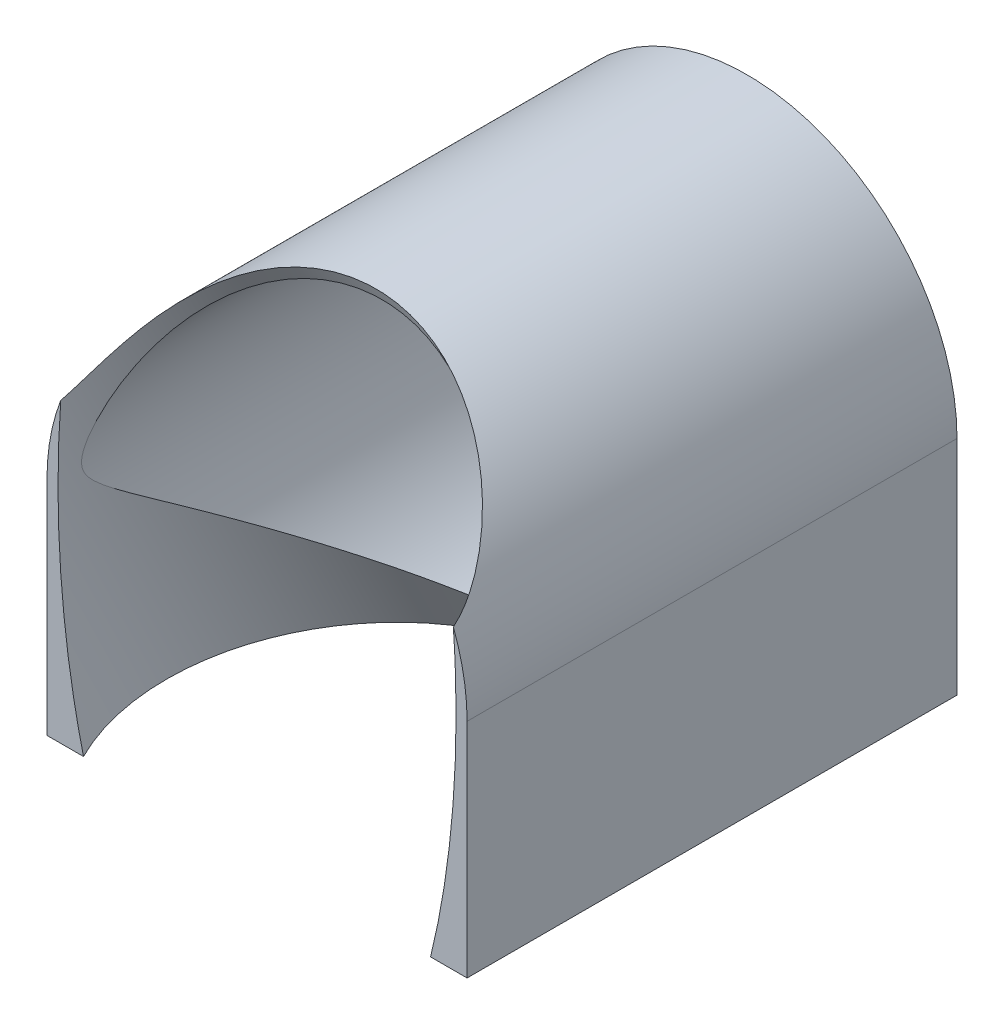
ISO-10303-21;
HEADER;
FILE_DESCRIPTION(('STEP AP214'),'2;1');
FILE_NAME('part.step','',(''),(''),'','','');
FILE_SCHEMA(('AUTOMOTIVE_DESIGN { 1 0 10303 214 1 1 1 1 }'));
ENDSEC;
DATA;
#1=APPLICATION_CONTEXT('core data for automotive mechanical design processes');
#2=APPLICATION_PROTOCOL_DEFINITION('international standard','automotive_design',2000,#1);
#3=PRODUCT_CONTEXT('',#1,'mechanical');
#4=PRODUCT('Part','Part','',(#3));
#5=PRODUCT_RELATED_PRODUCT_CATEGORY('part','',(#4));
#6=PRODUCT_DEFINITION_FORMATION('','',#4);
#7=PRODUCT_DEFINITION_CONTEXT('part definition',#1,'design');
#8=PRODUCT_DEFINITION('design','',#6,#7);
#9=PRODUCT_DEFINITION_SHAPE('','',#8);
#10=(LENGTH_UNIT() NAMED_UNIT(*) SI_UNIT(.MILLI.,.METRE.));
#11=(NAMED_UNIT(*) PLANE_ANGLE_UNIT() SI_UNIT($,.RADIAN.));
#12=(NAMED_UNIT(*) SI_UNIT($,.STERADIAN.) SOLID_ANGLE_UNIT());
#13=UNCERTAINTY_MEASURE_WITH_UNIT(LENGTH_MEASURE(1.E-05),#10,'distance_accuracy_value','');
#14=(GEOMETRIC_REPRESENTATION_CONTEXT(3) GLOBAL_UNCERTAINTY_ASSIGNED_CONTEXT((#13)) GLOBAL_UNIT_ASSIGNED_CONTEXT((#10,
#11,#12)) REPRESENTATION_CONTEXT('',''));
#15=CARTESIAN_POINT('',(0.,0.,0.));
#16=DIRECTION('',(0.,0.,1.));
#17=DIRECTION('',(1.,0.,0.));
#18=AXIS2_PLACEMENT_3D('',#15,#16,#17);
#19=CARTESIAN_POINT('',(1.14443168743842E-13,200.,0.));
#20=DIRECTION('',(0.,0.,1.));
#21=DIRECTION('',(1.,0.,0.));
#22=AXIS2_PLACEMENT_3D('',#19,#20,#21);
#23=PLANE('',#22);
#24=CARTESIAN_POINT('',(1.36789678735338E-13,200.,0.));
#25=DIRECTION('',(0.,0.,1.));
#26=DIRECTION('',(0.,1.,0.));
#27=AXIS2_PLACEMENT_3D('',#24,#25,#26);
#28=ELLIPSE('',#27,37.0690455314542,16.25);
#29=CARTESIAN_POINT('',(-16.0284663856791,206.100062731083,0.));
#30=VERTEX_POINT('',#29);
#31=CARTESIAN_POINT('',(-14.168896258274,181.85,0.));
#32=VERTEX_POINT('',#31);
#33=EDGE_CURVE('E66',#30,#32,#28,.T.);
#34=ORIENTED_EDGE('',*,*,#33,.F.);
#35=CARTESIAN_POINT('',(1.14443168743842E-13,200.,0.));
#36=DIRECTION('',(0.,0.,1.));
#37=DIRECTION('',(1.,0.,0.));
#38=AXIS2_PLACEMENT_3D('',#35,#36,#37);
#39=CIRCLE('',#38,17.15);
#40=CARTESIAN_POINT('',(-17.1499999999999,200.,0.));
#41=VERTEX_POINT('',#40);
#42=EDGE_CURVE('E146',#30,#41,#39,.T.);
#43=ORIENTED_EDGE('',*,*,#42,.T.);
#44=DIRECTION('',(0.,-1.,0.));
#45=VECTOR('',#44,1.);
#46=CARTESIAN_POINT('',(-17.1499999999999,0.,0.));
#47=LINE('',#46,#45);
#48=CARTESIAN_POINT('',(-17.1499999999999,181.85,0.));
#49=VERTEX_POINT('',#48);
#50=EDGE_CURVE('E137',#41,#49,#47,.T.);
#51=ORIENTED_EDGE('',*,*,#50,.T.);
#52=DIRECTION('',(-1.,0.,0.));
#53=VECTOR('',#52,1.);
#54=CARTESIAN_POINT('',(0.,181.85,0.));
#55=LINE('',#54,#53);
#56=EDGE_CURVE('E120',#32,#49,#55,.T.);
#57=ORIENTED_EDGE('',*,*,#56,.F.);
#58=EDGE_LOOP('',(#34,#43,#51,#57));
#59=FACE_BOUND('',#58,.T.);
#60=ADVANCED_FACE('F51',(#59),#23,.T.);
#61=CARTESIAN_POINT('',(1.14443168743842E-13,200.,-40.));
#62=DIRECTION('',(0.,0.,1.));
#63=DIRECTION('',(1.,0.,0.));
#64=AXIS2_PLACEMENT_3D('',#61,#62,#63);
#65=CYLINDRICAL_SURFACE('',#64,17.15);
#66=CARTESIAN_POINT('',(16.0284663856794,206.100062731083,0.));
#67=CARTESIAN_POINT('',(16.0035693887019,206.165497668741,-0.134176817252574));
#68=CARTESIAN_POINT('',(15.9765838025263,206.235185640167,-0.265804659911427));
#69=CARTESIAN_POINT('',(15.9186148492167,206.381719808303,-0.523931343012519));
#70=CARTESIAN_POINT('',(15.8876355891656,206.458558628831,-0.650435279615259));
#71=CARTESIAN_POINT('',(15.8219619035196,206.617810398107,-0.89797362019907));
#72=CARTESIAN_POINT('',(15.787285616479,206.700195462172,-1.0190309289728));
#73=CARTESIAN_POINT('',(15.7142349375846,206.869778848496,-1.25660189228727));
#74=CARTESIAN_POINT('',(15.6758595135254,206.956978511302,-1.37311426579747));
#75=CARTESIAN_POINT('',(15.5561259929083,207.222660083613,-1.71416634964782));
#76=CARTESIAN_POINT('',(15.4695413232124,207.406751533202,-1.93252250506272));
#77=CARTESIAN_POINT('',(15.2830309515676,207.784341215024,-2.35539506664162));
#78=CARTESIAN_POINT('',(15.1830846466506,207.97785367496,-2.55988934954964));
#79=CARTESIAN_POINT('',(14.9905077009909,208.333065258888,-2.91948585937056));
#80=CARTESIAN_POINT('',(14.9000490098969,208.493885757796,-3.07663267961096));
#81=CARTESIAN_POINT('',(14.7109395830836,208.817363606824,-3.38396342160481));
#82=CARTESIAN_POINT('',(14.6122878452738,208.980021179529,-3.53414648811131));
#83=CARTESIAN_POINT('',(14.3043034295008,209.468759707747,-3.97531490481303));
#84=CARTESIAN_POINT('',(14.0828897396415,209.795703309753,-4.25701491975776));
#85=CARTESIAN_POINT('',(13.6073551708901,210.446340718029,-4.80087950766523));
#86=CARTESIAN_POINT('',(13.3530403998825,210.770001900746,-5.06291242534395));
#87=CARTESIAN_POINT('',(12.8134612276792,211.406656832725,-5.56732388806869));
#88=CARTESIAN_POINT('',(12.5281985630956,211.719651179252,-5.80970353460734));
#89=CARTESIAN_POINT('',(11.91684592949,212.341313700815,-6.28363186478605));
#90=CARTESIAN_POINT('',(11.5896693075217,212.649437976628,-6.51449495544982));
#91=CARTESIAN_POINT('',(10.9039919653393,213.245063419357,-6.95550557143332));
#92=CARTESIAN_POINT('',(10.5454900715931,213.53256381291,-7.16565232003281));
#93=CARTESIAN_POINT('',(9.79936780153712,214.082228581921,-7.56390146784297));
#94=CARTESIAN_POINT('',(9.41180764046602,214.344442910087,-7.75204749274632));
#95=CARTESIAN_POINT('',(8.60888725039891,214.840220111021,-8.1054526249879));
#96=CARTESIAN_POINT('',(8.1935288768062,215.073784893073,-8.27071325756595));
#97=CARTESIAN_POINT('',(7.35249858210708,215.500899252211,-8.57145049433915));
#98=CARTESIAN_POINT('',(6.92769231468818,215.695560755177,-8.70776517926151));
#99=CARTESIAN_POINT('',(6.05744693954454,216.051504598148,-8.95615458684046));
#100=CARTESIAN_POINT('',(5.61200784378365,216.212786957509,-9.06822932355227));
#101=CARTESIAN_POINT('',(4.70425329186649,216.499057322902,-9.26667001345452));
#102=CARTESIAN_POINT('',(4.24194529671699,216.624061160803,-9.35304718142269));
#103=CARTESIAN_POINT('',(3.30445795603995,216.835493498158,-9.49891546074412));
#104=CARTESIAN_POINT('',(2.82928055617083,216.92192779459,-9.55841061246414));
#105=CARTESIAN_POINT('',(1.93338565474167,217.04586543538,-9.64365072058157));
#106=CARTESIAN_POINT('',(1.51366204184844,217.088285495645,-9.67278908808214));
#107=CARTESIAN_POINT('',(0.671312892274392,217.14205023961,-9.70971286388866));
#108=CARTESIAN_POINT('',(0.248687653370957,217.153398065666,-9.71750043141564));
#109=CARTESIAN_POINT('',(-0.595938165629724,217.144844120935,-9.71162811821244));
#110=CARTESIAN_POINT('',(-1.01793891524654,217.124953541585,-9.69797591847052));
#111=CARTESIAN_POINT('',(-1.8581049599103,217.054256098611,-9.64940939713555));
#112=CARTESIAN_POINT('',(-2.27627029431677,217.003449552613,-9.61449529398325));
#113=CARTESIAN_POINT('',(-3.08237938733667,216.875384799622,-9.52636342190131));
#114=CARTESIAN_POINT('',(-3.47070824108602,216.799759326969,-9.47427469729549));
#115=CARTESIAN_POINT('',(-4.23850150252785,216.622659573071,-9.35206487783011));
#116=CARTESIAN_POINT('',(-4.61796636809895,216.521186630241,-9.28194471666029));
#117=CARTESIAN_POINT('',(-5.36577460375933,216.293671532083,-9.12433911863367));
#118=CARTESIAN_POINT('',(-5.73411706317175,216.167627371186,-9.03685226425011));
#119=CARTESIAN_POINT('',(-6.45763439086232,215.892491101531,-8.84528143706862));
#120=CARTESIAN_POINT('',(-6.81280868991464,215.743397997862,-8.74119674781741));
#121=CARTESIAN_POINT('',(-7.52474238441101,215.416270776438,-8.51192650255711));
#122=CARTESIAN_POINT('',(-7.88077780204082,215.237199314563,-8.38597422693646));
#123=CARTESIAN_POINT('',(-8.57481368837911,214.857709037209,-8.11767582890879));
#124=CARTESIAN_POINT('',(-8.91281366366417,214.65728963813,-7.9753292583139));
#125=CARTESIAN_POINT('',(-9.56944227392364,214.23728105404,-7.67509555637316));
#126=CARTESIAN_POINT('',(-9.88807003286542,214.017691003203,-7.51720772307886));
#127=CARTESIAN_POINT('',(-10.5048686711896,213.561613756232,-7.18662867510186));
#128=CARTESIAN_POINT('',(-10.803039014922,213.325126117989,-7.0139370730685));
#129=CARTESIAN_POINT('',(-11.4117006100427,212.809090437216,-6.63326394663567));
#130=CARTESIAN_POINT('',(-11.7195612145921,212.527739589514,-6.42351663750149));
#131=CARTESIAN_POINT('',(-12.3078434541984,211.950287800174,-5.98655202650834));
#132=CARTESIAN_POINT('',(-12.5882625530591,211.654185498989,-5.75933311334946));
#133=CARTESIAN_POINT('',(-13.1215238824973,211.050370919868,-5.28663014208401));
#134=CARTESIAN_POINT('',(-13.3743043761889,210.742634636712,-5.04110717389827));
#135=CARTESIAN_POINT('',(-13.8509099711676,210.12067535899,-4.53108392845557));
#136=CARTESIAN_POINT('',(-14.0747440460843,209.806454409922,-4.26658957220703));
#137=CARTESIAN_POINT('',(-14.4289085986043,209.273509219333,-3.80011192015584));
#138=CARTESIAN_POINT('',(-14.5669086184983,209.054948909464,-3.60372899477269));
#139=CARTESIAN_POINT('',(-14.8283730751496,208.620101702412,-3.19895733948908));
#140=CARTESIAN_POINT('',(-14.9518348597438,208.40381522657,-2.99056642930597));
#141=CARTESIAN_POINT('',(-15.1829845279945,207.978573589694,-2.56111759951136));
#142=CARTESIAN_POINT('',(-15.2907696990066,207.769579921748,-2.34015079095997));
#143=CARTESIAN_POINT('',(-15.4907810071507,207.36270795152,-1.88170979824889));
#144=CARTESIAN_POINT('',(-15.5830187402933,207.164821439138,-1.64424810509629));
#145=CARTESIAN_POINT('',(-15.7402524208102,206.811708290113,-1.18105994431296));
#146=CARTESIAN_POINT('',(-15.8072249889915,206.654265360076,-0.957734133439967));
#147=CARTESIAN_POINT('',(-15.8977698130887,206.433493627914,-0.609376390500223));
#148=CARTESIAN_POINT('',(-15.926372091388,206.362272131989,-0.490640433081439));
#149=CARTESIAN_POINT('',(-15.980081161893,206.22614479906,-0.248683892703205));
#150=CARTESIAN_POINT('',(-16.0051844191472,206.161245368684,-0.125458930869115));
#151=CARTESIAN_POINT('',(-16.0284663856791,206.100062731083,0.));
#152=B_SPLINE_CURVE_WITH_KNOTS('',3,(#66,#67,#68,#69,#70,#71,#72,#73,#74,#75,#76,#77,#78,#79,
#80,#81,#82,#83,#84,#85,#86,#87,#88,#89,#90,#91,#92,#93,#94,#95,#96,#97,#98,#99,#100,#101,#102,
#103,#104,#105,#106,#107,#108,#109,#110,#111,#112,#113,#114,#115,#116,#117,#118,#119,#120,#121,
#122,#123,#124,#125,#126,#127,#128,#129,#130,#131,#132,#133,#134,#135,#136,#137,#138,#139,#140,
#141,#142,#143,#144,#145,#146,#147,#148,#149,#150,#151),.UNSPECIFIED.,.F.,.F.,(4,2,2,2,2,2,2,2,
2,2,2,2,2,2,2,2,2,2,2,2,2,2,2,2,2,2,2,2,2,2,2,2,2,2,2,2,2,2,2,2,2,2,4),(0.,0.453824436160271,
0.907185829112507,1.35841722194356,1.80977489267877,2.70403198600714,3.59968423467577,
4.32651679388222,5.05343838319347,6.50684648830143,7.96924722825319,9.43156594935709,
10.9455690292345,12.4596288522346,13.9706335895736,15.4815375746574,16.939718690352,
18.3978989605371,19.8554419238347,21.312765745508,22.5797305565195,23.8465672337837,
25.1129501590119,26.3793200738819,27.5750841755114,28.7707863714828,29.9665862047687,
31.1624376692911,32.4150142195495,33.6676250209266,34.9202924246556,36.1729926152887,
37.5720522617899,38.9712410901731,40.3734940753612,41.7753113030636,42.7487011942943,
43.7222683836885,44.6895092236757,45.6560254267878,46.4985876042233,46.9225016642781,
47.3468409345597),.UNSPECIFIED.);
#153=CARTESIAN_POINT('',(16.0284663856794,206.100062731083,0.));
#154=VERTEX_POINT('',#153);
#155=EDGE_CURVE('E163',#154,#30,#152,.T.);
#156=ORIENTED_EDGE('',*,*,#155,.F.);
#157=CARTESIAN_POINT('',(17.1500000000001,200.,0.));
#158=VERTEX_POINT('',#157);
#159=EDGE_CURVE('E114',#158,#154,#39,.T.);
#160=ORIENTED_EDGE('',*,*,#159,.F.);
#161=DIRECTION('',(0.,0.,-1.));
#162=VECTOR('',#161,1.);
#163=CARTESIAN_POINT('',(17.1500000000001,200.,0.));
#164=LINE('',#163,#162);
#165=CARTESIAN_POINT('',(17.1500000000001,200.,-40.));
#166=VERTEX_POINT('',#165);
#167=EDGE_CURVE('E122',#158,#166,#164,.T.);
#168=ORIENTED_EDGE('',*,*,#167,.T.);
#169=CARTESIAN_POINT('',(1.14443168743842E-13,200.,-40.));
#170=DIRECTION('',(0.,0.,1.));
#171=DIRECTION('',(1.,0.,0.));
#172=AXIS2_PLACEMENT_3D('',#169,#170,#171);
#173=CIRCLE('',#172,17.15);
#174=CARTESIAN_POINT('',(-17.1499999999999,200.,-40.));
#175=VERTEX_POINT('',#174);
#176=EDGE_CURVE('E60',#166,#175,#173,.T.);
#177=ORIENTED_EDGE('',*,*,#176,.T.);
#178=DIRECTION('',(0.,0.,-1.));
#179=VECTOR('',#178,1.);
#180=CARTESIAN_POINT('',(-17.1499999999999,200.,0.));
#181=LINE('',#180,#179);
#182=EDGE_CURVE('E119',#41,#175,#181,.T.);
#183=ORIENTED_EDGE('',*,*,#182,.F.);
#184=ORIENTED_EDGE('',*,*,#42,.F.);
#185=EDGE_LOOP('',(#156,#160,#168,#177,#183,#184));
#186=FACE_BOUND('',#185,.T.);
#187=ADVANCED_FACE('F53',(#186),#65,.T.);
#188=CARTESIAN_POINT('',(1.14443168743842E-13,200.,-40.));
#189=DIRECTION('',(0.,0.,1.));
#190=DIRECTION('',(1.,0.,0.));
#191=AXIS2_PLACEMENT_3D('',#188,#189,#190);
#192=PLANE('',#191);
#193=CARTESIAN_POINT('',(1.14443168743842E-13,200.,-40.));
#194=DIRECTION('',(0.,0.,1.));
#195=DIRECTION('',(1.,0.,0.));
#196=AXIS2_PLACEMENT_3D('',#193,#194,#195);
#197=CIRCLE('',#196,16.15);
#198=CARTESIAN_POINT('',(16.1500000000001,200.,-40.));
#199=VERTEX_POINT('',#198);
#200=EDGE_CURVE('E140',#199,#199,#197,.T.);
#201=ORIENTED_EDGE('',*,*,#200,.T.);
#202=EDGE_LOOP('',(#201));
#203=FACE_BOUND('',#202,.T.);
#204=ORIENTED_EDGE('',*,*,#176,.F.);
#205=DIRECTION('',(0.,-1.,0.));
#206=VECTOR('',#205,1.);
#207=CARTESIAN_POINT('',(17.1500000000001,0.,-40.));
#208=LINE('',#207,#206);
#209=CARTESIAN_POINT('',(17.1500000000001,181.85,-40.));
#210=VERTEX_POINT('',#209);
#211=EDGE_CURVE('E130',#166,#210,#208,.T.);
#212=ORIENTED_EDGE('',*,*,#211,.T.);
#213=DIRECTION('',(-1.,0.,0.));
#214=VECTOR('',#213,1.);
#215=CARTESIAN_POINT('',(0.,181.85,-40.));
#216=LINE('',#215,#214);
#217=CARTESIAN_POINT('',(-17.1499999999999,181.85,-40.));
#218=VERTEX_POINT('',#217);
#219=EDGE_CURVE('E134',#210,#218,#216,.T.);
#220=ORIENTED_EDGE('',*,*,#219,.T.);
#221=DIRECTION('',(0.,-1.,0.));
#222=VECTOR('',#221,1.);
#223=CARTESIAN_POINT('',(-17.1499999999999,0.,-40.));
#224=LINE('',#223,#222);
#225=EDGE_CURVE('E127',#175,#218,#224,.T.);
#226=ORIENTED_EDGE('',*,*,#225,.F.);
#227=EDGE_LOOP('',(#204,#212,#220,#226));
#228=FACE_BOUND('',#227,.T.);
#229=ADVANCED_FACE('F160',(#203,#228),#192,.F.);
#230=CARTESIAN_POINT('',(14.1688962582743,181.85,0.));
#231=VERTEX_POINT('',#230);
#232=EDGE_CURVE('E106',#231,#154,#28,.T.);
#233=ORIENTED_EDGE('',*,*,#232,.F.);
#234=CARTESIAN_POINT('',(17.1500000000001,181.85,0.));
#235=VERTEX_POINT('',#234);
#236=EDGE_CURVE('E112',#235,#231,#55,.T.);
#237=ORIENTED_EDGE('',*,*,#236,.F.);
#238=DIRECTION('',(0.,-1.,0.));
#239=VECTOR('',#238,1.);
#240=CARTESIAN_POINT('',(17.1500000000001,0.,0.));
#241=LINE('',#240,#239);
#242=EDGE_CURVE('E74',#158,#235,#241,.T.);
#243=ORIENTED_EDGE('',*,*,#242,.F.);
#244=ORIENTED_EDGE('',*,*,#159,.T.);
#245=EDGE_LOOP('',(#233,#237,#243,#244));
#246=FACE_BOUND('',#245,.T.);
#247=ADVANCED_FACE('F111',(#246),#23,.T.);
#248=CARTESIAN_POINT('',(1.14443168743842E-13,200.,-40.));
#249=DIRECTION('',(0.,0.,1.));
#250=DIRECTION('',(1.,0.,0.));
#251=AXIS2_PLACEMENT_3D('',#248,#249,#250);
#252=CYLINDRICAL_SURFACE('',#251,16.15);
#253=CARTESIAN_POINT('',(16.1500000000001,200.,-2.00268349285587));
#254=CARTESIAN_POINT('',(16.1499978188861,200.099703381823,-1.95407424594135));
#255=CARTESIAN_POINT('',(16.1490733913454,200.20313825143,-1.9129351650711));
#256=CARTESIAN_POINT('',(16.1450009399126,200.415540331801,-1.84939935869135));
#257=CARTESIAN_POINT('',(16.1418552982432,200.524501499584,-1.82698260990119));
#258=CARTESIAN_POINT('',(16.1332276239885,200.743970982128,-1.80107568481037));
#259=CARTESIAN_POINT('',(16.12775534426,200.854470996886,-1.79750732821835));
#260=CARTESIAN_POINT('',(16.1145756634252,201.074801255073,-1.80580346623866));
#261=CARTESIAN_POINT('',(16.1068634565106,201.184629534443,-1.81770133675174));
#262=CARTESIAN_POINT('',(16.0856345767757,201.448861097633,-1.86033572912969));
#263=CARTESIAN_POINT('',(16.0710472487828,201.60216814244,-1.89696538041807));
#264=CARTESIAN_POINT('',(16.0380435465148,201.904438295975,-1.98420012234466));
#265=CARTESIAN_POINT('',(16.0196176772661,202.053389568285,-2.034839972323));
#266=CARTESIAN_POINT('',(15.9789920940152,202.348766030866,-2.14515952455449));
#267=CARTESIAN_POINT('',(15.9567620186429,202.495159548337,-2.20491149670872));
#268=CARTESIAN_POINT('',(15.908774974442,202.784760169635,-2.32990063202012));
#269=CARTESIAN_POINT('',(15.8830218179647,202.927970525866,-2.39513183700353));
#270=CARTESIAN_POINT('',(15.8083261146622,203.313764368309,-2.57721126163777));
#271=CARTESIAN_POINT('',(15.75598837251,203.554035834799,-2.69755809063382));
#272=CARTESIAN_POINT('',(15.6411635676184,204.029423139081,-2.94355966512516));
#273=CARTESIAN_POINT('',(15.5786729163505,204.264537120497,-3.0692162756922));
#274=CARTESIAN_POINT('',(15.4435143958052,204.730677964904,-3.32336209611372));
#275=CARTESIAN_POINT('',(15.3708338252556,204.961699315512,-3.45185466982219));
#276=CARTESIAN_POINT('',(15.215378820555,205.419706947511,-3.70993630238725));
#277=CARTESIAN_POINT('',(15.1326033140736,205.646692797292,-3.83952547636674));
#278=CARTESIAN_POINT('',(14.8696605856777,206.320423283196,-4.22756595871251));
#279=CARTESIAN_POINT('',(14.6744603941203,206.761375133505,-4.48608813544804));
#280=CARTESIAN_POINT('',(14.2441866228659,207.626183898013,-4.99775337154102));
#281=CARTESIAN_POINT('',(14.0091355637207,208.050050301017,-5.25089937866221));
#282=CARTESIAN_POINT('',(13.4982967460574,208.880134886267,-5.74939318202576));
#283=CARTESIAN_POINT('',(13.2223625468644,209.286282535784,-5.99470892377148));
#284=CARTESIAN_POINT('',(12.6307710084118,210.076193687319,-6.47349775575078));
#285=CARTESIAN_POINT('',(12.3151056640832,210.459952655576,-6.70696844609409));
#286=CARTESIAN_POINT('',(11.6449563675435,211.201197538293,-7.15899160316028));
#287=CARTESIAN_POINT('',(11.2904970683033,211.558699899784,-7.37755340253288));
#288=CARTESIAN_POINT('',(10.7307514292892,212.072183603012,-7.69199061354998));
#289=CARTESIAN_POINT('',(10.5395066348154,212.239539834051,-7.79456260406174));
#290=CARTESIAN_POINT('',(10.1477762006072,212.566232254074,-7.99493411730486));
#291=CARTESIAN_POINT('',(9.94728821974432,212.725566389593,-8.09273241789186));
#292=CARTESIAN_POINT('',(9.41851579660722,213.125503069701,-8.33835824015645));
#293=CARTESIAN_POINT('',(9.08351617674871,213.359678248112,-8.48232599485754));
#294=CARTESIAN_POINT('',(8.39256704228076,213.804204304321,-8.75580986892401));
#295=CARTESIAN_POINT('',(8.03662140852816,214.014559574458,-8.88532865258355));
#296=CARTESIAN_POINT('',(7.30550667457182,214.409182366638,-9.1284366493158));
#297=CARTESIAN_POINT('',(6.930345343084,214.593460319854,-9.24203223164725));
#298=CARTESIAN_POINT('',(6.16274984516799,214.933829741902,-9.45193507097417));
#299=CARTESIAN_POINT('',(5.7703152719288,215.089920546441,-9.54824192052223));
#300=CARTESIAN_POINT('',(4.96864149586642,215.372594321693,-9.72270256603433));
#301=CARTESIAN_POINT('',(4.55932616777257,215.499021212072,-9.80076033481313));
#302=CARTESIAN_POINT('',(3.72880091274152,215.719514139496,-9.9369245925917));
#303=CARTESIAN_POINT('',(3.30759090101346,215.813579945792,-9.99503093932956));
#304=CARTESIAN_POINT('',(2.45681307576706,215.967887088463,-10.0903618195525));
#305=CARTESIAN_POINT('',(2.02724782606721,216.028138636528,-10.1275926573046));
#306=CARTESIAN_POINT('',(1.1633622084912,216.113890042669,-10.1805832222035));
#307=CARTESIAN_POINT('',(0.729042246095925,216.139392841195,-10.1963447660884));
#308=CARTESIAN_POINT('',(-0.101136127270862,216.154527152936,-10.2056981137946));
#309=CARTESIAN_POINT('',(-0.496922311731054,216.147192875794,-10.2011651687461));
#310=CARTESIAN_POINT('',(-1.28625952427903,216.103547620249,-10.1741923111391));
#311=CARTESIAN_POINT('',(-1.67981070565342,216.067238653834,-10.1517536419456));
#312=CARTESIAN_POINT('',(-2.46176001545648,215.96614068658,-10.0892842798083));
#313=CARTESIAN_POINT('',(-2.85015880155771,215.901355357325,-10.0492558547898));
#314=CARTESIAN_POINT('',(-3.61914644483074,215.744151268882,-9.95214472516903));
#315=CARTESIAN_POINT('',(-3.99973517227425,215.65173205108,-9.89506173752815));
#316=CARTESIAN_POINT('',(-4.74579304318083,215.441768246764,-9.76541209595302));
#317=CARTESIAN_POINT('',(-5.11139337357271,215.324560467846,-9.69305302296958));
#318=CARTESIAN_POINT('',(-5.8304132435971,215.065682505059,-9.53328796914474));
#319=CARTESIAN_POINT('',(-6.18383301548218,214.924012787927,-9.44588227539522));
#320=CARTESIAN_POINT('',(-6.87667751451233,214.617704574483,-9.25698227241505));
#321=CARTESIAN_POINT('',(-7.21610145586866,214.453064790797,-9.15548717353512));
#322=CARTESIAN_POINT('',(-7.87941410711342,214.102414716533,-8.93944054289398));
#323=CARTESIAN_POINT('',(-8.2033011714444,213.916402169352,-8.82488763245962));
#324=CARTESIAN_POINT('',(-8.85987192791722,213.508751098333,-8.57401221381644));
#325=CARTESIAN_POINT('',(-9.19113414453075,213.285446179098,-8.43667729526003));
#326=CARTESIAN_POINT('',(-9.83270756522887,212.817876341318,-8.14938499441107));
#327=CARTESIAN_POINT('',(-10.1430177429253,212.573610397275,-7.99942699455253));
#328=CARTESIAN_POINT('',(-10.7418791436209,212.066013830988,-7.68817824389868));
#329=CARTESIAN_POINT('',(-11.0304184987499,211.802672961605,-7.52688140321776));
#330=CARTESIAN_POINT('',(-11.5848659560901,211.258959873771,-7.19437024369201));
#331=CARTESIAN_POINT('',(-11.8507715271875,210.9785857565,-7.0231548192504));
#332=CARTESIAN_POINT('',(-12.3948567242806,210.362510063315,-6.64770087690619));
#333=CARTESIAN_POINT('',(-12.6695896920379,210.024540662887,-6.44218380010205));
#334=CARTESIAN_POINT('',(-13.1884299747904,209.331409815114,-6.02206751273322));
#335=CARTESIAN_POINT('',(-13.4325447627315,208.976252592223,-5.80747053545691));
#336=CARTESIAN_POINT('',(-13.8898874002975,208.250897511795,-5.37128142663752));
#337=CARTESIAN_POINT('',(-14.1031245328812,207.88070421769,-5.14969142195759));
#338=CARTESIAN_POINT('',(-14.4985941580172,207.127016726925,-4.70185155369697));
#339=CARTESIAN_POINT('',(-14.6808361927734,206.74352666776,-4.47560314839393));
#340=CARTESIAN_POINT('',(-14.9919085853792,206.016624504774,-4.05201207573696));
#341=CARTESIAN_POINT('',(-15.1246253236737,205.674749557107,-3.85486951831519));
#342=CARTESIAN_POINT('',(-15.3666410633771,204.982298534059,-3.46263775233332));
#343=CARTESIAN_POINT('',(-15.4759723232318,204.631735198799,-3.26754607285505));
#344=CARTESIAN_POINT('',(-15.6467043221481,204.009890157755,-2.93319897536631));
#345=CARTESIAN_POINT('',(-15.7132389770805,203.740913368582,-2.79227139555177));
#346=CARTESIAN_POINT('',(-15.8333283196961,203.194798061087,-2.51921888847852));
#347=CARTESIAN_POINT('',(-15.8868530786432,202.917642338256,-2.3871147557148));
#348=CARTESIAN_POINT('',(-15.9697997362265,202.416015874184,-2.17086272447946));
#349=CARTESIAN_POINT('',(-16.0019349510794,202.193849685599,-2.08263308177481));
#350=CARTESIAN_POINT('',(-16.0436791552713,201.853599454176,-1.96941143070432));
#351=CARTESIAN_POINT('',(-16.0565061977927,201.739153972735,-1.93488729753079));
#352=CARTESIAN_POINT('',(-16.0798936745139,201.507660354052,-1.87528051698434));
#353=CARTESIAN_POINT('',(-16.0904568908854,201.390615608841,-1.85018625167399));
#354=CARTESIAN_POINT('',(-16.109329253108,201.151780126946,-1.8133094695461));
#355=CARTESIAN_POINT('',(-16.1175918050841,201.02994147487,-1.8017886836335));
#356=CARTESIAN_POINT('',(-16.1313169949289,200.78606568905,-1.79861469565174));
#357=CARTESIAN_POINT('',(-16.1367910477681,200.664031449811,-1.80687969300319));
#358=CARTESIAN_POINT('',(-16.1449263774238,200.422578514092,-1.84699030886361));
#359=CARTESIAN_POINT('',(-16.1475626769109,200.303191959392,-1.87904119337397));
#360=CARTESIAN_POINT('',(-16.1502538317353,200.07237335986,-1.96488733616958));
#361=CARTESIAN_POINT('',(-16.1503015450082,199.960964169611,-2.01874234148131));
#362=CARTESIAN_POINT('',(-16.1478851022364,199.692138438416,-2.17387671782739));
#363=CARTESIAN_POINT('',(-16.1441084072944,199.540745616216,-2.2852759175379));
#364=CARTESIAN_POINT('',(-16.1360741896663,199.325666893423,-2.46616977974357));
#365=CARTESIAN_POINT('',(-16.1329884251709,199.255784695855,-2.52897586863569));
#366=CARTESIAN_POINT('',(-16.1261134384783,199.119300859476,-2.65802228683179));
#367=CARTESIAN_POINT('',(-16.1223245012413,199.05269790554,-2.72426121717031));
#368=CARTESIAN_POINT('',(-16.1085148188789,198.832793520173,-2.95139714243079));
#369=CARTESIAN_POINT('',(-16.0970559405893,198.68544478935,-3.11790331326473));
#370=CARTESIAN_POINT('',(-16.0711155796767,198.399295223396,-3.45793455556228));
#371=CARTESIAN_POINT('',(-16.056631338433,198.260502340389,-3.63146591557895));
#372=CARTESIAN_POINT('',(-16.0247845381261,197.988130518049,-3.98295309697272));
#373=CARTESIAN_POINT('',(-16.0074153230798,197.85456453938,-4.16091832143886));
#374=CARTESIAN_POINT('',(-15.9698997364589,197.591171351807,-4.51931487492073));
#375=CARTESIAN_POINT('',(-15.9497530430787,197.461344578248,-4.69974648751304));
#376=CARTESIAN_POINT('',(-15.8850111018112,197.074659991822,-5.24487536441364));
#377=CARTESIAN_POINT('',(-15.8362514431395,196.821745526246,-5.6118779720057));
#378=CARTESIAN_POINT('',(-15.727729477634,196.322227251252,-6.34770125688608));
#379=CARTESIAN_POINT('',(-15.6679832655521,196.075614803922,-6.71651851641548));
#380=CARTESIAN_POINT('',(-15.5101829734623,195.485010159565,-7.60780277648806));
#381=CARTESIAN_POINT('',(-15.4065139262164,195.143011549843,-8.13060955239282));
#382=CARTESIAN_POINT('',(-15.1759641789046,194.464585796758,-9.17480499130467));
#383=CARTESIAN_POINT('',(-15.049080662312,194.128159334851,-9.69619347443709));
#384=CARTESIAN_POINT('',(-14.7708652285144,193.459716454727,-10.7364862855604));
#385=CARTESIAN_POINT('',(-14.6194957420243,193.127707675605,-11.255385514037));
#386=CARTESIAN_POINT('',(-14.2911514697663,192.468665079436,-12.2881992511875));
#387=CARTESIAN_POINT('',(-14.1141782869977,192.141630952351,-12.8021140697781));
#388=CARTESIAN_POINT('',(-13.7342197749922,191.495095197183,-13.8199919537623));
#389=CARTESIAN_POINT('',(-13.5314090484812,191.175558653068,-14.3239977644431));
#390=CARTESIAN_POINT('',(-13.096906640097,190.542679845462,-15.3235493399841));
#391=CARTESIAN_POINT('',(-12.8652110074148,190.229338436131,-15.8190939369772));
#392=CARTESIAN_POINT('',(-12.3710197550619,189.610734547068,-16.7983503147555));
#393=CARTESIAN_POINT('',(-12.1085802286334,189.3054585619,-17.2820817580911));
#394=CARTESIAN_POINT('',(-11.5497763009004,188.704267080552,-18.2354026474209));
#395=CARTESIAN_POINT('',(-11.2534264758804,188.408347631776,-18.7049980609402));
#396=CARTESIAN_POINT('',(-10.7468645354177,187.942011808728,-19.4454385214153));
#397=CARTESIAN_POINT('',(-10.5484302643707,187.767874421637,-19.7220273977088));
#398=CARTESIAN_POINT('',(-10.1368367355229,187.424672481076,-20.2673069749148));
#399=CARTESIAN_POINT('',(-9.92367821895325,187.255607672862,-20.5359980724388));
#400=CARTESIAN_POINT('',(-9.48146838030362,186.923271407762,-21.064305115389));
#401=CARTESIAN_POINT('',(-9.25240169843956,186.760005786594,-21.3239119155976));
#402=CARTESIAN_POINT('',(-8.77754669589191,186.44053599305,-21.8320062684747));
#403=CARTESIAN_POINT('',(-8.53175821311278,186.28433188915,-22.0804937133171));
#404=CARTESIAN_POINT('',(-8.02014241464253,185.978966921864,-22.5663535017153));
#405=CARTESIAN_POINT('',(-7.7541540975442,185.829882454503,-22.8036051214219));
#406=CARTESIAN_POINT('',(-7.20311174238566,185.541981060643,-23.2618406793099));
#407=CARTESIAN_POINT('',(-6.91805543815383,185.403165358698,-23.4828226773174));
#408=CARTESIAN_POINT('',(-6.32862176467061,185.138125516356,-23.9047975753946));
#409=CARTESIAN_POINT('',(-6.02427400316674,185.011882810141,-24.1058199473161));
#410=CARTESIAN_POINT('',(-5.39571154778155,184.774313553945,-24.4841537164625));
#411=CARTESIAN_POINT('',(-5.07150781135892,184.662978883199,-24.6614780224929));
#412=CARTESIAN_POINT('',(-4.50597422507614,184.489440455018,-24.9378986322077));
#413=CARTESIAN_POINT('',(-4.26962895051826,184.422625407879,-25.0443322143427));
#414=CARTESIAN_POINT('',(-3.78827796888251,184.298625638083,-25.2418685361852));
#415=CARTESIAN_POINT('',(-3.54327732350427,184.241435396005,-25.3329800624232));
#416=CARTESIAN_POINT('',(-3.04554641871346,184.137726509904,-25.4982083670001));
#417=CARTESIAN_POINT('',(-2.79282086530522,184.091201509896,-25.5723352673696));
#418=CARTESIAN_POINT('',(-2.28079569467681,184.009763786802,-25.7020913061835));
#419=CARTESIAN_POINT('',(-2.02149602469658,183.974851156944,-25.7577202961238));
#420=CARTESIAN_POINT('',(-1.49608900891983,183.917258860526,-25.8494882178243));
#421=CARTESIAN_POINT('',(-1.22994535029342,183.894672212831,-25.8854789478566));
#422=CARTESIAN_POINT('',(-0.69484748200266,183.862729061986,-25.9363791933501));
#423=CARTESIAN_POINT('',(-0.425893296165755,183.853372446765,-25.9512888873891));
#424=CARTESIAN_POINT('',(0.112453870772922,183.848148398145,-25.9596133414896));
#425=CARTESIAN_POINT('',(0.381846807625855,183.852279679616,-25.9530301493998));
#426=CARTESIAN_POINT('',(0.918709791608289,183.873914338865,-25.9185558234207));
#427=CARTESIAN_POINT('',(1.18617991547029,183.891417180008,-25.8906655446383));
#428=CARTESIAN_POINT('',(1.69180976932546,183.937045631511,-25.8179596934485));
#429=CARTESIAN_POINT('',(1.93034586440684,183.964007885396,-25.7749977272065));
#430=CARTESIAN_POINT('',(2.40269490669137,184.027950036315,-25.6731146411931));
#431=CARTESIAN_POINT('',(2.63650609271592,184.064933597324,-25.6141876843278));
#432=CARTESIAN_POINT('',(3.09816259517837,184.148220459095,-25.4814894762386));
#433=CARTESIAN_POINT('',(3.32600775239911,184.194524008297,-25.4077178293056));
#434=CARTESIAN_POINT('',(3.77490210202888,184.295682605292,-25.2465576802814));
#435=CARTESIAN_POINT('',(3.99594963395378,184.350539722945,-25.1591658822819));
#436=CARTESIAN_POINT('',(4.53268095626287,184.495590476645,-24.9281010924075));
#437=CARTESIAN_POINT('',(4.84408549469557,184.590284528853,-24.7772645464051));
#438=CARTESIAN_POINT('',(5.44990367740173,184.793971367544,-24.4528481130064));
#439=CARTESIAN_POINT('',(5.74431013832694,184.902970136395,-24.2792587101859));
#440=CARTESIAN_POINT('',(6.31646395871468,185.133256260249,-23.9125532875463));
#441=CARTESIAN_POINT('',(6.5941774447845,185.254567342446,-23.7193995666178));
#442=CARTESIAN_POINT('',(7.13263342486521,185.507363922605,-23.316948541704));
#443=CARTESIAN_POINT('',(7.39337604948137,185.63884934225,-23.1076513619836));
#444=CARTESIAN_POINT('',(8.05414088765907,185.993995133471,-22.5424250150724));
#445=CARTESIAN_POINT('',(8.44110512968014,186.224575394114,-22.1755369622471));
#446=CARTESIAN_POINT('',(9.17605839954303,186.702826848188,-21.4148174753662));
#447=CARTESIAN_POINT('',(9.52402216985105,186.950508951278,-21.0209688439413));
#448=CARTESIAN_POINT('',(10.1850466789529,187.459598402024,-20.211778207137));
#449=CARTESIAN_POINT('',(10.4980305568237,187.721034187402,-19.7963916968436));
#450=CARTESIAN_POINT('',(11.0914164394364,188.254274796851,-18.9495787664278));
#451=CARTESIAN_POINT('',(11.3718229568749,188.526078177831,-18.518154578839));
#452=CARTESIAN_POINT('',(11.8763532789477,189.050412231402,-17.6864384815102));
#453=CARTESIAN_POINT('',(12.1033012943679,189.302151297322,-17.2873489120223));
#454=CARTESIAN_POINT('',(12.5349279879938,189.811306197143,-16.480762079763));
#455=CARTESIAN_POINT('',(12.7396030207678,190.068722952047,-16.0732634536218));
#456=CARTESIAN_POINT('',(13.1282863620364,190.588518741026,-15.2511792606448));
#457=CARTESIAN_POINT('',(13.3122793892749,190.850901279081,-14.8365887110384));
#458=CARTESIAN_POINT('',(13.6606989811814,191.379787033973,-14.0019108795795));
#459=CARTESIAN_POINT('',(13.825126592485,191.646290029528,-13.5818238930899));
#460=CARTESIAN_POINT('',(14.1354573231007,192.182879839841,-12.7373661694196));
#461=CARTESIAN_POINT('',(14.2813668973569,192.452965369353,-12.3129969809023));
#462=CARTESIAN_POINT('',(14.5556458678773,192.996546845744,-11.4607845541456));
#463=CARTESIAN_POINT('',(14.6840147712917,193.270042888214,-11.0329412186489));
#464=CARTESIAN_POINT('',(14.9239040878334,193.820226639792,-10.1749590914242));
#465=CARTESIAN_POINT('',(15.0354338500122,194.096912485397,-9.74482171171165));
#466=CARTESIAN_POINT('',(15.2423550485622,194.653843120383,-8.88301505909124));
#467=CARTESIAN_POINT('',(15.3377475576751,194.934087671863,-8.45134588996002));
#468=CARTESIAN_POINT('',(15.4907630951322,195.427523545041,-7.69686683894242));
#469=CARTESIAN_POINT('',(15.5518379230504,195.639756128134,-7.3741243311329));
#470=CARTESIAN_POINT('',(15.6654295725558,196.06734268397,-6.72916827426072));
#471=CARTESIAN_POINT('',(15.7179459513149,196.2826968176,-6.40695475342206));
#472=CARTESIAN_POINT('',(15.8145450731828,196.717873934865,-5.76414025367697));
#473=CARTESIAN_POINT('',(15.858625184819,196.937698289291,-5.44353980819238));
#474=CARTESIAN_POINT('',(15.9383647830729,197.384148064846,-4.80612703467253));
#475=CARTESIAN_POINT('',(15.9740269677401,197.610771280536,-4.48931352386974));
#476=CARTESIAN_POINT('',(16.0199180075469,197.95147481107,-4.0322427335536));
#477=CARTESIAN_POINT('',(16.0335140826885,198.060572379573,-3.88861800047545));
#478=CARTESIAN_POINT('',(16.058818564928,198.282627747467,-3.60422773703177));
#479=CARTESIAN_POINT('',(16.070527283422,198.395584906327,-3.46346173835866));
#480=CARTESIAN_POINT('',(16.0919558797477,198.627054387812,-3.18642419405716));
#481=CARTESIAN_POINT('',(16.1016761402685,198.745565636117,-3.05015178785639));
#482=CARTESIAN_POINT('',(16.1189110376417,198.990861566976,-2.78520693226128));
#483=CARTESIAN_POINT('',(16.1264281866311,199.117636623263,-2.6565259614379));
#484=CARTESIAN_POINT('',(16.1378855236111,199.364324661085,-2.43073116626182));
#485=CARTESIAN_POINT('',(16.1421900509769,199.482485287902,-2.33176213944949));
#486=CARTESIAN_POINT('',(16.1482429875556,199.731426327297,-2.15138194250019));
#487=CARTESIAN_POINT('',(16.1500030156883,199.862146450735,-2.06989241888963));
#488=CARTESIAN_POINT('',(16.1500000000001,200.,-2.00268349285587));
#489=B_SPLINE_CURVE_WITH_KNOTS('',3,(#253,#254,#255,#256,#257,#258,#259,#260,#261,#262,#263,
#264,#265,#266,#267,#268,#269,#270,#271,#272,#273,#274,#275,#276,#277,#278,#279,#280,#281,#282,
#283,#284,#285,#286,#287,#288,#289,#290,#291,#292,#293,#294,#295,#296,#297,#298,#299,#300,#301,
#302,#303,#304,#305,#306,#307,#308,#309,#310,#311,#312,#313,#314,#315,#316,#317,#318,#319,#320,
#321,#322,#323,#324,#325,#326,#327,#328,#329,#330,#331,#332,#333,#334,#335,#336,#337,#338,#339,
#340,#341,#342,#343,#344,#345,#346,#347,#348,#349,#350,#351,#352,#353,#354,#355,#356,#357,#358,
#359,#360,#361,#362,#363,#364,#365,#366,#367,#368,#369,#370,#371,#372,#373,#374,#375,#376,#377,
#378,#379,#380,#381,#382,#383,#384,#385,#386,#387,#388,#389,#390,#391,#392,#393,#394,#395,#396,
#397,#398,#399,#400,#401,#402,#403,#404,#405,#406,#407,#408,#409,#410,#411,#412,#413,#414,#415,
#416,#417,#418,#419,#420,#421,#422,#423,#424,#425,#426,#427,#428,#429,#430,#431,#432,#433,#434,
#435,#436,#437,#438,#439,#440,#441,#442,#443,#444,#445,#446,#447,#448,#449,#450,#451,#452,#453,
#454,#455,#456,#457,#458,#459,#460,#461,#462,#463,#464,#465,#466,#467,#468,#469,#470,#471,#472,
#473,#474,#475,#476,#477,#478,#479,#480,#481,#482,#483,#484,#485,#486,#487,#488),.UNSPECIFIED.,
.T.,.F.,(4,2,2,2,2,2,2,2,2,2,2,2,2,2,2,2,2,2,2,2,2,2,2,2,2,2,2,2,2,2,2,2,2,2,2,2,2,2,2,2,2,2,2,
2,2,2,2,2,2,2,2,2,2,2,2,2,2,2,2,2,2,2,2,2,2,2,2,2,2,2,2,2,2,2,2,2,2,2,2,2,2,2,2,2,2,2,2,2,2,2,2,
2,2,2,2,2,2,2,2,2,2,2,2,2,2,2,2,2,2,2,2,2,2,2,2,2,2,4),(0.,0.332423096548543,0.664490214181222,
0.995178879612602,1.32658235259501,1.80019801112727,2.27499941469129,2.75378383308654,
3.23205419428014,4.05297203059712,4.87418065269542,5.69642212801957,6.51875102181199,
8.15834276877714,9.79701101821085,11.4416975011231,13.0867158890882,14.730694896973,
15.5525787023042,16.3746718316891,17.6732854139576,18.9716591433409,20.2695120338901,
21.5673955072123,22.8719620405444,24.1765378757838,25.4807195251824,26.7847908074755,
27.9709799528081,29.1570867368964,30.3430406358202,31.5290142180092,32.6998047105663,
33.8705728667332,35.0414066658252,36.2123641988888,37.478409679503,38.7445171355998,
40.0113098683457,41.278244079657,42.7215939947919,44.1645909447273,45.6071531719977,
47.0492704825201,48.2976470371072,49.5442902865415,50.4765017544493,51.4108378600456,
52.1333035934406,52.493693461534,52.8536378491017,53.2204148378418,53.5856780770245,
53.9541306421606,54.3235997384232,54.8842501389373,55.1662693167548,55.4481744551315,
56.1154714341678,56.783379552686,57.4528505831844,58.1223992455803,59.4672420652151,
60.8101302294306,62.7094817707897,64.6090639065222,66.5115887442822,68.4139945200433,
70.3041659647816,72.1945962269264,74.0816295369687,75.9678547346051,77.1146083524398,
78.2613042837265,79.409123202847,80.5569532501252,81.7151550138793,82.8734946717548,
84.0300976943345,85.1860681018358,85.9884432377795,86.7903566658394,87.5917909413113,
88.3932316506668,89.2006396714456,90.008040852621,90.8153651066131,91.6226569623556,
92.3534743487691,93.0845592968807,93.8156637358265,94.5469453685092,95.6214692403242,
96.6964439289091,97.7735310325843,98.8506098461747,100.590658870407,102.331828354313,
104.076751442551,105.821432530788,107.391603566668,108.962031208029,110.533611663916,
112.105108011591,113.676055059905,115.247046238889,116.817161974338,118.387173293558,
119.560286358393,120.733460102768,121.906999193673,123.080161638534,123.622734124693,
124.165216999692,124.70759537265,125.249352861165,125.711088366657,126.170708721343),.UNSPECIFIED.);
#490=CARTESIAN_POINT('',(16.1500000000001,200.,-2.00268349285587));
#491=VERTEX_POINT('',#490);
#492=EDGE_CURVE('E131',#491,#491,#489,.T.);
#493=ORIENTED_EDGE('',*,*,#492,.T.);
#494=EDGE_LOOP('',(#493));
#495=FACE_BOUND('',#494,.T.);
#496=ORIENTED_EDGE('',*,*,#200,.F.);
#497=EDGE_LOOP('',(#496));
#498=FACE_BOUND('',#497,.T.);
#499=ADVANCED_FACE('F185',(#495,#498),#252,.F.);
#500=CARTESIAN_POINT('',(-17.1499999999999,0.,0.));
#501=DIRECTION('',(1.,0.,0.));
#502=DIRECTION('',(0.,0.,-1.));
#503=AXIS2_PLACEMENT_3D('',#500,#501,#502);
#504=PLANE('',#503);
#505=ORIENTED_EDGE('',*,*,#225,.T.);
#506=DIRECTION('',(0.,0.,-1.));
#507=VECTOR('',#506,1.);
#508=CARTESIAN_POINT('',(-17.1499999999999,181.85,0.));
#509=LINE('',#508,#507);
#510=EDGE_CURVE('E138',#49,#218,#509,.T.);
#511=ORIENTED_EDGE('',*,*,#510,.F.);
#512=ORIENTED_EDGE('',*,*,#50,.F.);
#513=ORIENTED_EDGE('',*,*,#182,.T.);
#514=EDGE_LOOP('',(#505,#511,#512,#513));
#515=FACE_BOUND('',#514,.T.);
#516=ADVANCED_FACE('F156',(#515),#504,.F.);
#517=CARTESIAN_POINT('',(0.,181.85,0.));
#518=DIRECTION('',(0.,-1.,0.));
#519=DIRECTION('',(0.,0.,-1.));
#520=AXIS2_PLACEMENT_3D('',#517,#518,#519);
#521=PLANE('',#520);
#522=CARTESIAN_POINT('',(1.25944504970507E-13,181.85,-8.85234648247036));
#523=DIRECTION('',(0.,-1.,0.));
#524=DIRECTION('',(0.,0.,1.));
#525=AXIS2_PLACEMENT_3D('',#522,#523,#524);
#526=ELLIPSE('',#525,18.0797815327218,16.25);
#527=EDGE_CURVE('E13',#32,#231,#526,.T.);
#528=ORIENTED_EDGE('',*,*,#527,.F.);
#529=ORIENTED_EDGE('',*,*,#56,.T.);
#530=ORIENTED_EDGE('',*,*,#510,.T.);
#531=ORIENTED_EDGE('',*,*,#219,.F.);
#532=DIRECTION('',(0.,0.,-1.));
#533=VECTOR('',#532,1.);
#534=CARTESIAN_POINT('',(17.1500000000001,181.85,0.));
#535=LINE('',#534,#533);
#536=EDGE_CURVE('E118',#235,#210,#535,.T.);
#537=ORIENTED_EDGE('',*,*,#536,.F.);
#538=ORIENTED_EDGE('',*,*,#236,.T.);
#539=EDGE_LOOP('',(#528,#529,#530,#531,#537,#538));
#540=FACE_BOUND('',#539,.T.);
#541=ADVANCED_FACE('F116',(#540),#521,.T.);
#542=CARTESIAN_POINT('',(17.1500000000001,0.,0.));
#543=DIRECTION('',(1.,0.,0.));
#544=DIRECTION('',(0.,0.,-1.));
#545=AXIS2_PLACEMENT_3D('',#542,#543,#544);
#546=PLANE('',#545);
#547=ORIENTED_EDGE('',*,*,#211,.F.);
#548=ORIENTED_EDGE('',*,*,#167,.F.);
#549=ORIENTED_EDGE('',*,*,#242,.T.);
#550=ORIENTED_EDGE('',*,*,#536,.T.);
#551=EDGE_LOOP('',(#547,#548,#549,#550));
#552=FACE_BOUND('',#551,.T.);
#553=ADVANCED_FACE('F162',(#552),#546,.T.);
#554=CARTESIAN_POINT('',(1.18611408997474E-13,169.577657039285,-14.8379680824678));
#555=DIRECTION('',(0.,0.898794046299168,0.438371146789076));
#556=DIRECTION('',(0.,-0.438371146789076,0.898794046299168));
#557=AXIS2_PLACEMENT_3D('',#554,#555,#556);
#558=CYLINDRICAL_SURFACE('',#557,16.25);
#559=ORIENTED_EDGE('',*,*,#155,.T.);
#560=ORIENTED_EDGE('',*,*,#33,.T.);
#561=ORIENTED_EDGE('',*,*,#527,.T.);
#562=ORIENTED_EDGE('',*,*,#232,.T.);
#563=EDGE_LOOP('',(#559,#560,#561,#562));
#564=FACE_BOUND('',#563,.T.);
#565=ORIENTED_EDGE('',*,*,#492,.F.);
#566=EDGE_LOOP('',(#565));
#567=FACE_BOUND('',#566,.T.);
#568=ADVANCED_FACE('F104',(#564,#567),#558,.F.);
#569=CLOSED_SHELL('',(#60,#187,#229,#247,#499,#516,#541,#553,#568));
#570=MANIFOLD_SOLID_BREP('B2',#569);
#571=ADVANCED_BREP_SHAPE_REPRESENTATION('',(#18,#570),#14);
#572=SHAPE_DEFINITION_REPRESENTATION(#9,#571);
ENDSEC;
END-ISO-10303-21;
